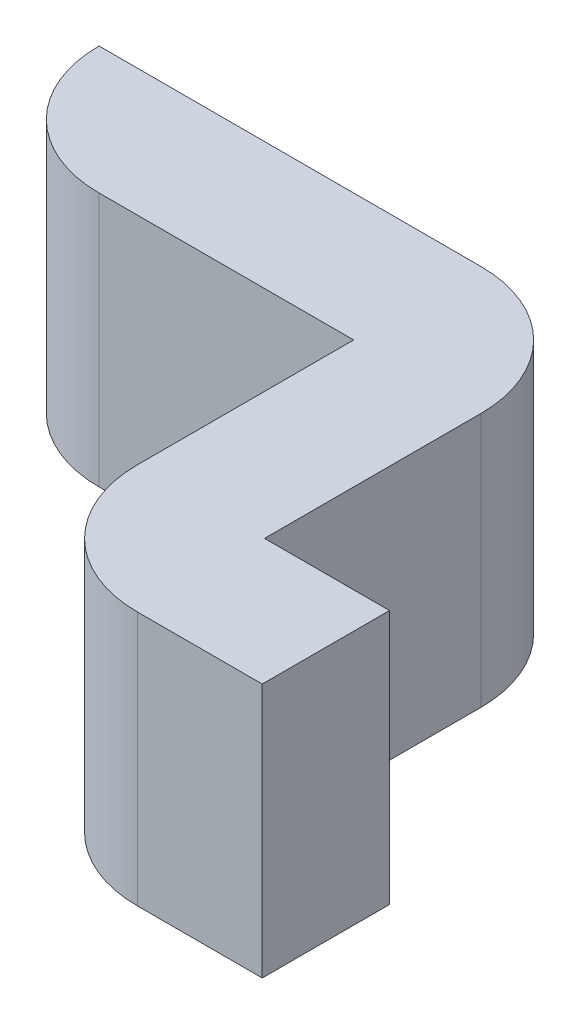
ISO-10303-21;
HEADER;
FILE_DESCRIPTION(('STEP AP214'),'2;1');
FILE_NAME('part.step','',(''),(''),'','','');
FILE_SCHEMA(('AUTOMOTIVE_DESIGN { 1 0 10303 214 1 1 1 1 }'));
ENDSEC;
DATA;
#1=APPLICATION_CONTEXT('core data for automotive mechanical design processes');
#2=APPLICATION_PROTOCOL_DEFINITION('international standard','automotive_design',2000,#1);
#3=PRODUCT_CONTEXT('',#1,'mechanical');
#4=PRODUCT('Part','Part','',(#3));
#5=PRODUCT_RELATED_PRODUCT_CATEGORY('part','',(#4));
#6=PRODUCT_DEFINITION_FORMATION('','',#4);
#7=PRODUCT_DEFINITION_CONTEXT('part definition',#1,'design');
#8=PRODUCT_DEFINITION('design','',#6,#7);
#9=PRODUCT_DEFINITION_SHAPE('','',#8);
#10=(LENGTH_UNIT() NAMED_UNIT(*) SI_UNIT(.MILLI.,.METRE.));
#11=(NAMED_UNIT(*) PLANE_ANGLE_UNIT() SI_UNIT($,.RADIAN.));
#12=(NAMED_UNIT(*) SI_UNIT($,.STERADIAN.) SOLID_ANGLE_UNIT());
#13=UNCERTAINTY_MEASURE_WITH_UNIT(LENGTH_MEASURE(1.E-05),#10,'distance_accuracy_value','');
#14=(GEOMETRIC_REPRESENTATION_CONTEXT(3) GLOBAL_UNCERTAINTY_ASSIGNED_CONTEXT((#13)) GLOBAL_UNIT_ASSIGNED_CONTEXT((#10,
#11,#12)) REPRESENTATION_CONTEXT('',''));
#15=CARTESIAN_POINT('',(0.,0.,0.));
#16=DIRECTION('',(0.,0.,1.));
#17=DIRECTION('',(1.,0.,0.));
#18=AXIS2_PLACEMENT_3D('',#15,#16,#17);
#19=CARTESIAN_POINT('',(-0.0889,-1.0922,0.));
#20=DIRECTION('',(0.,-1.,0.));
#21=DIRECTION('',(0.,0.,-1.));
#22=AXIS2_PLACEMENT_3D('',#19,#20,#21);
#23=PLANE('',#22);
#24=DIRECTION('',(-1.,0.,0.));
#25=VECTOR('',#24,1.);
#26=CARTESIAN_POINT('',(0.0381,-1.0922,0.127));
#27=LINE('',#26,#25);
#28=CARTESIAN_POINT('',(0.0381,-1.0922,0.127));
#29=VERTEX_POINT('',#28);
#30=CARTESIAN_POINT('',(0.2921,-1.0922,0.127));
#31=VERTEX_POINT('',#30);
#32=EDGE_CURVE('E102',#29,#31,#27,.F.);
#33=ORIENTED_EDGE('',*,*,#32,.T.);
#34=DIRECTION('',(0.,0.,-1.));
#35=VECTOR('',#34,1.);
#36=CARTESIAN_POINT('',(0.2921,-1.0922,0.127));
#37=LINE('',#36,#35);
#38=CARTESIAN_POINT('',(0.2921,-1.0922,0.3429));
#39=VERTEX_POINT('',#38);
#40=EDGE_CURVE('E105',#31,#39,#37,.F.);
#41=ORIENTED_EDGE('',*,*,#40,.T.);
#42=CARTESIAN_POINT('',(0.4191,-1.0922,0.3429));
#43=DIRECTION('',(0.,-1.,0.));
#44=DIRECTION('',(0.,0.,-1.));
#45=AXIS2_PLACEMENT_3D('',#42,#43,#44);
#46=CIRCLE('',#45,0.127);
#47=CARTESIAN_POINT('',(0.4191,-1.0922,0.4699));
#48=VERTEX_POINT('',#47);
#49=EDGE_CURVE('E117',#48,#39,#46,.T.);
#50=ORIENTED_EDGE('',*,*,#49,.F.);
#51=DIRECTION('',(-1.,0.,0.));
#52=VECTOR('',#51,1.);
#53=CARTESIAN_POINT('',(0.4191,-1.0922,0.4699));
#54=LINE('',#53,#52);
#55=CARTESIAN_POINT('',(0.5438,-1.0922,0.4699));
#56=VERTEX_POINT('',#55);
#57=EDGE_CURVE('E134',#48,#56,#54,.F.);
#58=ORIENTED_EDGE('',*,*,#57,.T.);
#59=DIRECTION('',(0.,0.,1.));
#60=VECTOR('',#59,1.);
#61=CARTESIAN_POINT('',(0.5438,-1.0922,0.4699));
#62=LINE('',#61,#60);
#63=CARTESIAN_POINT('',(0.5438,-1.0922,0.3429));
#64=VERTEX_POINT('',#63);
#65=EDGE_CURVE('E90',#56,#64,#62,.F.);
#66=ORIENTED_EDGE('',*,*,#65,.T.);
#67=DIRECTION('',(1.,0.,0.));
#68=VECTOR('',#67,1.);
#69=CARTESIAN_POINT('',(0.5438,-1.0922,0.3429));
#70=LINE('',#69,#68);
#71=CARTESIAN_POINT('',(0.4191,-1.0922,0.3429));
#72=VERTEX_POINT('',#71);
#73=EDGE_CURVE('E87',#64,#72,#70,.F.);
#74=ORIENTED_EDGE('',*,*,#73,.T.);
#75=DIRECTION('',(0.,0.,1.));
#76=VECTOR('',#75,1.);
#77=CARTESIAN_POINT('',(0.4191,-1.0922,0.3429));
#78=LINE('',#77,#76);
#79=CARTESIAN_POINT('',(0.4191,-1.0922,0.127));
#80=VERTEX_POINT('',#79);
#81=EDGE_CURVE('E82',#72,#80,#78,.F.);
#82=ORIENTED_EDGE('',*,*,#81,.T.);
#83=CARTESIAN_POINT('',(0.2921,-1.0922,0.127));
#84=DIRECTION('',(0.,-1.,0.));
#85=DIRECTION('',(0.,0.,-1.));
#86=AXIS2_PLACEMENT_3D('',#83,#84,#85);
#87=CIRCLE('',#86,0.127);
#88=CARTESIAN_POINT('',(0.2921,-1.0922,0.));
#89=VERTEX_POINT('',#88);
#90=EDGE_CURVE('E20',#89,#80,#87,.T.);
#91=ORIENTED_EDGE('',*,*,#90,.F.);
#92=DIRECTION('',(1.,0.,0.));
#93=VECTOR('',#92,1.);
#94=CARTESIAN_POINT('',(0.2921,-1.0922,0.));
#95=LINE('',#94,#93);
#96=CARTESIAN_POINT('',(-0.0889,-1.0922,0.));
#97=VERTEX_POINT('',#96);
#98=EDGE_CURVE('E76',#89,#97,#95,.F.);
#99=ORIENTED_EDGE('',*,*,#98,.T.);
#100=CARTESIAN_POINT('',(0.0381,-1.0922,0.));
#101=DIRECTION('',(0.,-1.,0.));
#102=DIRECTION('',(0.,0.,-1.));
#103=AXIS2_PLACEMENT_3D('',#100,#101,#102);
#104=CIRCLE('',#103,0.127);
#105=EDGE_CURVE('E108',#29,#97,#104,.T.);
#106=ORIENTED_EDGE('',*,*,#105,.F.);
#107=EDGE_LOOP('',(#33,#41,#50,#58,#66,#74,#82,#91,#99,#106));
#108=FACE_BOUND('',#107,.T.);
#109=ADVANCED_FACE('F17',(#108),#23,.F.);
#110=CARTESIAN_POINT('',(0.2921,-1.3462,0.));
#111=DIRECTION('',(0.,0.,1.));
#112=DIRECTION('',(1.,0.,0.));
#113=AXIS2_PLACEMENT_3D('',#110,#111,#112);
#114=PLANE('',#113);
#115=DIRECTION('',(0.,-1.,0.));
#116=VECTOR('',#115,1.);
#117=CARTESIAN_POINT('',(-0.0889,-1.3462,0.));
#118=LINE('',#117,#116);
#119=CARTESIAN_POINT('',(-0.0889,-1.3462,0.));
#120=VERTEX_POINT('',#119);
#121=EDGE_CURVE('E187',#97,#120,#118,.T.);
#122=ORIENTED_EDGE('',*,*,#121,.F.);
#123=ORIENTED_EDGE('',*,*,#98,.F.);
#124=DIRECTION('',(0.,-1.,0.));
#125=VECTOR('',#124,1.);
#126=CARTESIAN_POINT('',(0.2921,-1.3462,0.));
#127=LINE('',#126,#125);
#128=CARTESIAN_POINT('',(0.2921,-1.3462,0.));
#129=VERTEX_POINT('',#128);
#130=EDGE_CURVE('E159',#129,#89,#127,.F.);
#131=ORIENTED_EDGE('',*,*,#130,.F.);
#132=DIRECTION('',(1.,0.,0.));
#133=VECTOR('',#132,1.);
#134=CARTESIAN_POINT('',(-0.0889,-1.3462,0.));
#135=LINE('',#134,#133);
#136=EDGE_CURVE('E186',#120,#129,#135,.T.);
#137=ORIENTED_EDGE('',*,*,#136,.F.);
#138=EDGE_LOOP('',(#122,#123,#131,#137));
#139=FACE_BOUND('',#138,.T.);
#140=ADVANCED_FACE('F217',(#139),#114,.F.);
#141=CARTESIAN_POINT('',(0.2921,-1.3462,0.127));
#142=DIRECTION('',(0.,-1.,0.));
#143=DIRECTION('',(0.,0.,-1.));
#144=AXIS2_PLACEMENT_3D('',#141,#142,#143);
#145=CYLINDRICAL_SURFACE('',#144,0.127);
#146=ORIENTED_EDGE('',*,*,#90,.T.);
#147=DIRECTION('',(0.,1.,0.));
#148=VECTOR('',#147,1.);
#149=CARTESIAN_POINT('',(0.4191,-1.3462,0.127));
#150=LINE('',#149,#148);
#151=CARTESIAN_POINT('',(0.4191,-1.3462,0.127));
#152=VERTEX_POINT('',#151);
#153=EDGE_CURVE('E157',#80,#152,#150,.F.);
#154=ORIENTED_EDGE('',*,*,#153,.T.);
#155=CARTESIAN_POINT('',(0.2921,-1.3462,0.127));
#156=DIRECTION('',(0.,-1.,0.));
#157=DIRECTION('',(0.,0.,-1.));
#158=AXIS2_PLACEMENT_3D('',#155,#156,#157);
#159=CIRCLE('',#158,0.127);
#160=EDGE_CURVE('E183',#129,#152,#159,.T.);
#161=ORIENTED_EDGE('',*,*,#160,.F.);
#162=ORIENTED_EDGE('',*,*,#130,.T.);
#163=EDGE_LOOP('',(#146,#154,#161,#162));
#164=FACE_BOUND('',#163,.T.);
#165=ADVANCED_FACE('F214',(#164),#145,.T.);
#166=CARTESIAN_POINT('',(0.4191,-1.3462,0.3429));
#167=DIRECTION('',(-1.,0.,0.));
#168=DIRECTION('',(0.,0.,1.));
#169=AXIS2_PLACEMENT_3D('',#166,#167,#168);
#170=PLANE('',#169);
#171=ORIENTED_EDGE('',*,*,#153,.F.);
#172=ORIENTED_EDGE('',*,*,#81,.F.);
#173=DIRECTION('',(0.,1.,0.));
#174=VECTOR('',#173,1.);
#175=CARTESIAN_POINT('',(0.4191,-1.3462,0.3429));
#176=LINE('',#175,#174);
#177=CARTESIAN_POINT('',(0.4191,-1.3462,0.3429));
#178=VERTEX_POINT('',#177);
#179=EDGE_CURVE('E153',#72,#178,#176,.F.);
#180=ORIENTED_EDGE('',*,*,#179,.T.);
#181=DIRECTION('',(0.,0.,-1.));
#182=VECTOR('',#181,1.);
#183=CARTESIAN_POINT('',(0.4191,-1.3462,0.));
#184=LINE('',#183,#182);
#185=EDGE_CURVE('E150',#152,#178,#184,.F.);
#186=ORIENTED_EDGE('',*,*,#185,.F.);
#187=EDGE_LOOP('',(#171,#172,#180,#186));
#188=FACE_BOUND('',#187,.T.);
#189=ADVANCED_FACE('F211',(#188),#170,.F.);
#190=CARTESIAN_POINT('',(0.5438,-1.3462,0.3429));
#191=DIRECTION('',(0.,0.,1.));
#192=DIRECTION('',(1.,0.,0.));
#193=AXIS2_PLACEMENT_3D('',#190,#191,#192);
#194=PLANE('',#193);
#195=ORIENTED_EDGE('',*,*,#179,.F.);
#196=ORIENTED_EDGE('',*,*,#73,.F.);
#197=DIRECTION('',(0.,1.,0.));
#198=VECTOR('',#197,1.);
#199=CARTESIAN_POINT('',(0.5438,-1.3462,0.3429));
#200=LINE('',#199,#198);
#201=CARTESIAN_POINT('',(0.5438,-1.3462,0.3429));
#202=VERTEX_POINT('',#201);
#203=EDGE_CURVE('E144',#64,#202,#200,.F.);
#204=ORIENTED_EDGE('',*,*,#203,.T.);
#205=DIRECTION('',(1.,0.,0.));
#206=VECTOR('',#205,1.);
#207=CARTESIAN_POINT('',(-0.0889,-1.3462,0.3429));
#208=LINE('',#207,#206);
#209=EDGE_CURVE('E141',#178,#202,#208,.T.);
#210=ORIENTED_EDGE('',*,*,#209,.F.);
#211=EDGE_LOOP('',(#195,#196,#204,#210));
#212=FACE_BOUND('',#211,.T.);
#213=ADVANCED_FACE('F208',(#212),#194,.F.);
#214=CARTESIAN_POINT('',(0.5438,-1.3462,0.4699));
#215=DIRECTION('',(-1.,0.,0.));
#216=DIRECTION('',(0.,0.,1.));
#217=AXIS2_PLACEMENT_3D('',#214,#215,#216);
#218=PLANE('',#217);
#219=ORIENTED_EDGE('',*,*,#203,.F.);
#220=ORIENTED_EDGE('',*,*,#65,.F.);
#221=DIRECTION('',(0.,1.,0.));
#222=VECTOR('',#221,1.);
#223=CARTESIAN_POINT('',(0.5438,-1.3462,0.4699));
#224=LINE('',#223,#222);
#225=CARTESIAN_POINT('',(0.5438,-1.3462,0.4699));
#226=VERTEX_POINT('',#225);
#227=EDGE_CURVE('E132',#56,#226,#224,.F.);
#228=ORIENTED_EDGE('',*,*,#227,.T.);
#229=DIRECTION('',(0.,0.,-1.));
#230=VECTOR('',#229,1.);
#231=CARTESIAN_POINT('',(0.5438,-1.3462,0.));
#232=LINE('',#231,#230);
#233=EDGE_CURVE('E137',#202,#226,#232,.F.);
#234=ORIENTED_EDGE('',*,*,#233,.F.);
#235=EDGE_LOOP('',(#219,#220,#228,#234));
#236=FACE_BOUND('',#235,.T.);
#237=ADVANCED_FACE('F195',(#236),#218,.F.);
#238=CARTESIAN_POINT('',(0.4191,-1.3462,0.4699));
#239=DIRECTION('',(0.,0.,-1.));
#240=DIRECTION('',(-1.,0.,0.));
#241=AXIS2_PLACEMENT_3D('',#238,#239,#240);
#242=PLANE('',#241);
#243=ORIENTED_EDGE('',*,*,#227,.F.);
#244=ORIENTED_EDGE('',*,*,#57,.F.);
#245=DIRECTION('',(0.,-1.,0.));
#246=VECTOR('',#245,1.);
#247=CARTESIAN_POINT('',(0.4191,-1.3462,0.4699));
#248=LINE('',#247,#246);
#249=CARTESIAN_POINT('',(0.4191,-1.3462,0.4699));
#250=VERTEX_POINT('',#249);
#251=EDGE_CURVE('E129',#250,#48,#248,.F.);
#252=ORIENTED_EDGE('',*,*,#251,.F.);
#253=DIRECTION('',(1.,0.,0.));
#254=VECTOR('',#253,1.);
#255=CARTESIAN_POINT('',(-0.0889,-1.3462,0.4699));
#256=LINE('',#255,#254);
#257=EDGE_CURVE('E140',#226,#250,#256,.F.);
#258=ORIENTED_EDGE('',*,*,#257,.F.);
#259=EDGE_LOOP('',(#243,#244,#252,#258));
#260=FACE_BOUND('',#259,.T.);
#261=ADVANCED_FACE('F198',(#260),#242,.F.);
#262=CARTESIAN_POINT('',(0.4191,-1.3462,0.3429));
#263=DIRECTION('',(0.,-1.,0.));
#264=DIRECTION('',(0.,0.,-1.));
#265=AXIS2_PLACEMENT_3D('',#262,#263,#264);
#266=CYLINDRICAL_SURFACE('',#265,0.127);
#267=ORIENTED_EDGE('',*,*,#49,.T.);
#268=DIRECTION('',(0.,1.,0.));
#269=VECTOR('',#268,1.);
#270=CARTESIAN_POINT('',(0.2921,-1.3462,0.3429));
#271=LINE('',#270,#269);
#272=CARTESIAN_POINT('',(0.2921,-1.3462,0.3429));
#273=VERTEX_POINT('',#272);
#274=EDGE_CURVE('E111',#39,#273,#271,.F.);
#275=ORIENTED_EDGE('',*,*,#274,.T.);
#276=CARTESIAN_POINT('',(0.4191,-1.3462,0.3429));
#277=DIRECTION('',(0.,-1.,0.));
#278=DIRECTION('',(0.,0.,-1.));
#279=AXIS2_PLACEMENT_3D('',#276,#277,#278);
#280=CIRCLE('',#279,0.127);
#281=EDGE_CURVE('E179',#250,#273,#280,.T.);
#282=ORIENTED_EDGE('',*,*,#281,.F.);
#283=ORIENTED_EDGE('',*,*,#251,.T.);
#284=EDGE_LOOP('',(#267,#275,#282,#283));
#285=FACE_BOUND('',#284,.T.);
#286=ADVANCED_FACE('F189',(#285),#266,.T.);
#287=CARTESIAN_POINT('',(0.2921,-1.3462,0.127));
#288=DIRECTION('',(1.,0.,0.));
#289=DIRECTION('',(0.,0.,-1.));
#290=AXIS2_PLACEMENT_3D('',#287,#288,#289);
#291=PLANE('',#290);
#292=ORIENTED_EDGE('',*,*,#274,.F.);
#293=ORIENTED_EDGE('',*,*,#40,.F.);
#294=DIRECTION('',(0.,1.,0.));
#295=VECTOR('',#294,1.);
#296=CARTESIAN_POINT('',(0.2921,-1.3462,0.127));
#297=LINE('',#296,#295);
#298=CARTESIAN_POINT('',(0.2921,-1.3462,0.127));
#299=VERTEX_POINT('',#298);
#300=EDGE_CURVE('E110',#31,#299,#297,.F.);
#301=ORIENTED_EDGE('',*,*,#300,.T.);
#302=DIRECTION('',(0.,0.,-1.));
#303=VECTOR('',#302,1.);
#304=CARTESIAN_POINT('',(0.2921,-1.3462,0.));
#305=LINE('',#304,#303);
#306=EDGE_CURVE('E182',#273,#299,#305,.T.);
#307=ORIENTED_EDGE('',*,*,#306,.F.);
#308=EDGE_LOOP('',(#292,#293,#301,#307));
#309=FACE_BOUND('',#308,.T.);
#310=ADVANCED_FACE('F115',(#309),#291,.F.);
#311=CARTESIAN_POINT('',(0.0381,-1.3462,0.127));
#312=DIRECTION('',(0.,0.,-1.));
#313=DIRECTION('',(-1.,0.,0.));
#314=AXIS2_PLACEMENT_3D('',#311,#312,#313);
#315=PLANE('',#314);
#316=ORIENTED_EDGE('',*,*,#300,.F.);
#317=ORIENTED_EDGE('',*,*,#32,.F.);
#318=DIRECTION('',(0.,-1.,0.));
#319=VECTOR('',#318,1.);
#320=CARTESIAN_POINT('',(0.0381,-1.3462,0.127));
#321=LINE('',#320,#319);
#322=CARTESIAN_POINT('',(0.0381,-1.3462,0.127));
#323=VERTEX_POINT('',#322);
#324=EDGE_CURVE('E35',#323,#29,#321,.F.);
#325=ORIENTED_EDGE('',*,*,#324,.F.);
#326=DIRECTION('',(1.,0.,0.));
#327=VECTOR('',#326,1.);
#328=CARTESIAN_POINT('',(-0.0889,-1.3462,0.127));
#329=LINE('',#328,#327);
#330=EDGE_CURVE('E26',#299,#323,#329,.F.);
#331=ORIENTED_EDGE('',*,*,#330,.F.);
#332=EDGE_LOOP('',(#316,#317,#325,#331));
#333=FACE_BOUND('',#332,.T.);
#334=ADVANCED_FACE('F119',(#333),#315,.F.);
#335=CARTESIAN_POINT('',(0.0381,-1.3462,0.));
#336=DIRECTION('',(0.,-1.,0.));
#337=DIRECTION('',(0.,0.,-1.));
#338=AXIS2_PLACEMENT_3D('',#335,#336,#337);
#339=CYLINDRICAL_SURFACE('',#338,0.127);
#340=ORIENTED_EDGE('',*,*,#105,.T.);
#341=ORIENTED_EDGE('',*,*,#121,.T.);
#342=CARTESIAN_POINT('',(0.0381,-1.3462,0.));
#343=DIRECTION('',(0.,-1.,0.));
#344=DIRECTION('',(0.,0.,-1.));
#345=AXIS2_PLACEMENT_3D('',#342,#343,#344);
#346=CIRCLE('',#345,0.127);
#347=EDGE_CURVE('E11',#323,#120,#346,.T.);
#348=ORIENTED_EDGE('',*,*,#347,.F.);
#349=ORIENTED_EDGE('',*,*,#324,.T.);
#350=EDGE_LOOP('',(#340,#341,#348,#349));
#351=FACE_BOUND('',#350,.T.);
#352=ADVANCED_FACE('F219',(#351),#339,.T.);
#353=CARTESIAN_POINT('',(-0.0889,-1.3462,0.));
#354=DIRECTION('',(0.,-1.,0.));
#355=DIRECTION('',(0.,0.,-1.));
#356=AXIS2_PLACEMENT_3D('',#353,#354,#355);
#357=PLANE('',#356);
#358=ORIENTED_EDGE('',*,*,#330,.T.);
#359=ORIENTED_EDGE('',*,*,#347,.T.);
#360=ORIENTED_EDGE('',*,*,#136,.T.);
#361=ORIENTED_EDGE('',*,*,#160,.T.);
#362=ORIENTED_EDGE('',*,*,#185,.T.);
#363=ORIENTED_EDGE('',*,*,#209,.T.);
#364=ORIENTED_EDGE('',*,*,#233,.T.);
#365=ORIENTED_EDGE('',*,*,#257,.T.);
#366=ORIENTED_EDGE('',*,*,#281,.T.);
#367=ORIENTED_EDGE('',*,*,#306,.T.);
#368=EDGE_LOOP('',(#358,#359,#360,#361,#362,#363,#364,#365,#366,#367));
#369=FACE_BOUND('',#368,.T.);
#370=ADVANCED_FACE('F202',(#369),#357,.T.);
#371=CLOSED_SHELL('',(#109,#140,#165,#189,#213,#237,#261,#286,#310,#334,#352,#370));
#372=MANIFOLD_SOLID_BREP('B1',#371);
#373=ADVANCED_BREP_SHAPE_REPRESENTATION('',(#18,#372),#14);
#374=SHAPE_DEFINITION_REPRESENTATION(#9,#373);
ENDSEC;
END-ISO-10303-21;
